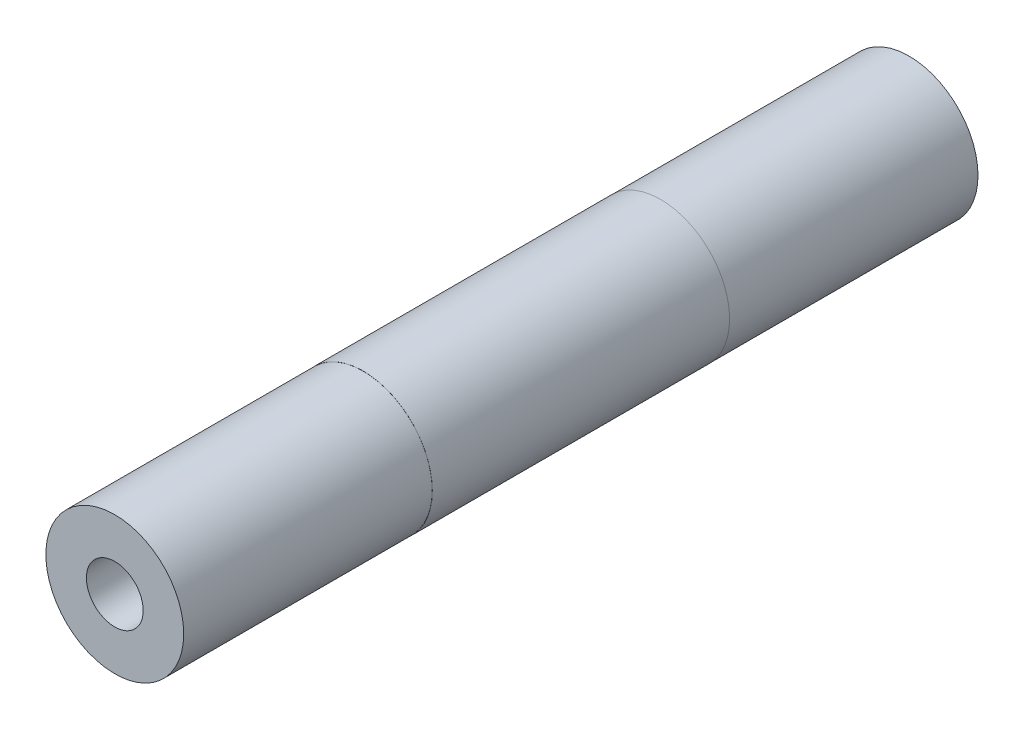
ISO-10303-21;
HEADER;
FILE_DESCRIPTION(('STEP AP214'),'2;1');
FILE_NAME('part.step','',(''),(''),'','','');
FILE_SCHEMA(('AUTOMOTIVE_DESIGN { 1 0 10303 214 1 1 1 1 }'));
ENDSEC;
DATA;
#1=APPLICATION_CONTEXT('core data for automotive mechanical design processes');
#2=APPLICATION_PROTOCOL_DEFINITION('international standard','automotive_design',2000,#1);
#3=PRODUCT_CONTEXT('',#1,'mechanical');
#4=PRODUCT('Part','Part','',(#3));
#5=PRODUCT_RELATED_PRODUCT_CATEGORY('part','',(#4));
#6=PRODUCT_DEFINITION_FORMATION('','',#4);
#7=PRODUCT_DEFINITION_CONTEXT('part definition',#1,'design');
#8=PRODUCT_DEFINITION('design','',#6,#7);
#9=PRODUCT_DEFINITION_SHAPE('','',#8);
#10=(LENGTH_UNIT() NAMED_UNIT(*) SI_UNIT(.MILLI.,.METRE.));
#11=(NAMED_UNIT(*) PLANE_ANGLE_UNIT() SI_UNIT($,.RADIAN.));
#12=(NAMED_UNIT(*) SI_UNIT($,.STERADIAN.) SOLID_ANGLE_UNIT());
#13=UNCERTAINTY_MEASURE_WITH_UNIT(LENGTH_MEASURE(1.E-05),#10,'distance_accuracy_value','');
#14=(GEOMETRIC_REPRESENTATION_CONTEXT(3) GLOBAL_UNCERTAINTY_ASSIGNED_CONTEXT((#13)) GLOBAL_UNIT_ASSIGNED_CONTEXT((#10,
#11,#12)) REPRESENTATION_CONTEXT('',''));
#15=CARTESIAN_POINT('',(0.,0.,0.));
#16=DIRECTION('',(0.,0.,1.));
#17=DIRECTION('',(1.,0.,0.));
#18=AXIS2_PLACEMENT_3D('',#15,#16,#17);
#19=CARTESIAN_POINT('',(0.,0.,45.6692));
#20=DIRECTION('',(0.,0.,-1.));
#21=DIRECTION('',(-1.,0.,0.));
#22=AXIS2_PLACEMENT_3D('',#19,#20,#21);
#23=CYLINDRICAL_SURFACE('',#22,7.9375);
#24=CARTESIAN_POINT('',(0.,0.,17.0942));
#25=DIRECTION('',(0.,0.,1.));
#26=DIRECTION('',(1.,0.,0.));
#27=AXIS2_PLACEMENT_3D('',#24,#25,#26);
#28=CIRCLE('',#27,7.9375);
#29=CARTESIAN_POINT('',(7.9375,0.,17.0942));
#30=VERTEX_POINT('',#29);
#31=EDGE_CURVE('E65',#30,#30,#28,.T.);
#32=ORIENTED_EDGE('',*,*,#31,.F.);
#33=EDGE_LOOP('',(#32));
#34=FACE_BOUND('',#33,.T.);
#35=CARTESIAN_POINT('',(0.,0.,-17.0942));
#36=DIRECTION('',(0.,0.,1.));
#37=DIRECTION('',(1.,0.,0.));
#38=AXIS2_PLACEMENT_3D('',#35,#36,#37);
#39=CIRCLE('',#38,7.9375);
#40=CARTESIAN_POINT('',(7.9375,0.,-17.0942));
#41=VERTEX_POINT('',#40);
#42=EDGE_CURVE('E74',#41,#41,#39,.T.);
#43=ORIENTED_EDGE('',*,*,#42,.T.);
#44=EDGE_LOOP('',(#43));
#45=FACE_BOUND('',#44,.T.);
#46=ADVANCED_FACE('F38',(#34,#45),#23,.T.);
#47=CARTESIAN_POINT('',(0.,0.,17.0942));
#48=DIRECTION('',(0.,0.,1.));
#49=DIRECTION('',(1.,0.,0.));
#50=AXIS2_PLACEMENT_3D('',#47,#48,#49);
#51=PLANE('',#50);
#52=CARTESIAN_POINT('',(0.,0.,17.0942));
#53=DIRECTION('',(0.,0.,1.));
#54=DIRECTION('',(1.,0.,0.));
#55=AXIS2_PLACEMENT_3D('',#52,#53,#54);
#56=CIRCLE('',#55,7.9248);
#57=CARTESIAN_POINT('',(7.9248,0.,17.0942));
#58=VERTEX_POINT('',#57);
#59=EDGE_CURVE('E70',#58,#58,#56,.T.);
#60=ORIENTED_EDGE('',*,*,#59,.F.);
#61=EDGE_LOOP('',(#60));
#62=FACE_BOUND('',#61,.T.);
#63=ORIENTED_EDGE('',*,*,#31,.T.);
#64=EDGE_LOOP('',(#63));
#65=FACE_BOUND('',#64,.T.);
#66=ADVANCED_FACE('F103',(#62,#65),#51,.T.);
#67=CARTESIAN_POINT('',(0.,0.,17.0942));
#68=DIRECTION('',(0.,0.,1.));
#69=DIRECTION('',(1.,0.,0.));
#70=AXIS2_PLACEMENT_3D('',#67,#68,#69);
#71=CYLINDRICAL_SURFACE('',#70,7.9248);
#72=ORIENTED_EDGE('',*,*,#59,.T.);
#73=EDGE_LOOP('',(#72));
#74=FACE_BOUND('',#73,.T.);
#75=CARTESIAN_POINT('',(0.,0.,45.6692));
#76=DIRECTION('',(0.,0.,1.));
#77=DIRECTION('',(1.,0.,0.));
#78=AXIS2_PLACEMENT_3D('',#75,#76,#77);
#79=CIRCLE('',#78,7.9248);
#80=CARTESIAN_POINT('',(7.9248,0.,45.6692));
#81=VERTEX_POINT('',#80);
#82=EDGE_CURVE('E71',#81,#81,#79,.T.);
#83=ORIENTED_EDGE('',*,*,#82,.F.);
#84=EDGE_LOOP('',(#83));
#85=FACE_BOUND('',#84,.T.);
#86=ADVANCED_FACE('F108',(#74,#85),#71,.T.);
#87=CARTESIAN_POINT('',(0.,0.,25.6032));
#88=DIRECTION('',(0.,0.,1.));
#89=DIRECTION('',(1.,0.,0.));
#90=AXIS2_PLACEMENT_3D('',#87,#88,#89);
#91=CONICAL_SURFACE('',#90,3.2639,1.02974425867665);
#92=CARTESIAN_POINT('',(0.,0.,23.6420510255559));
#93=VERTEX_POINT('',#92);
#94=VERTEX_LOOP('',#93);
#95=FACE_BOUND('',#94,.T.);
#96=CARTESIAN_POINT('',(0.,0.,25.6032));
#97=DIRECTION('',(0.,0.,1.));
#98=DIRECTION('',(1.,0.,0.));
#99=AXIS2_PLACEMENT_3D('',#96,#97,#98);
#100=CIRCLE('',#99,3.2639);
#101=CARTESIAN_POINT('',(3.2639,0.,25.6032));
#102=VERTEX_POINT('',#101);
#103=EDGE_CURVE('E11',#102,#102,#100,.T.);
#104=ORIENTED_EDGE('',*,*,#103,.T.);
#105=EDGE_LOOP('',(#104));
#106=FACE_BOUND('',#105,.T.);
#107=ADVANCED_FACE('F125',(#95,#106),#91,.F.);
#108=CARTESIAN_POINT('',(0.,0.,45.6692));
#109=DIRECTION('',(0.,0.,1.));
#110=DIRECTION('',(1.,0.,0.));
#111=AXIS2_PLACEMENT_3D('',#108,#109,#110);
#112=CYLINDRICAL_SURFACE('',#111,3.2639);
#113=ORIENTED_EDGE('',*,*,#103,.F.);
#114=EDGE_LOOP('',(#113));
#115=FACE_BOUND('',#114,.T.);
#116=CARTESIAN_POINT('',(0.,0.,45.6692));
#117=DIRECTION('',(0.,0.,1.));
#118=DIRECTION('',(1.,0.,0.));
#119=AXIS2_PLACEMENT_3D('',#116,#117,#118);
#120=CIRCLE('',#119,3.2639);
#121=CARTESIAN_POINT('',(3.2639,0.,45.6692));
#122=VERTEX_POINT('',#121);
#123=EDGE_CURVE('E45',#122,#122,#120,.T.);
#124=ORIENTED_EDGE('',*,*,#123,.T.);
#125=EDGE_LOOP('',(#124));
#126=FACE_BOUND('',#125,.T.);
#127=ADVANCED_FACE('F121',(#115,#126),#112,.F.);
#128=CARTESIAN_POINT('',(0.,0.,45.6692));
#129=DIRECTION('',(0.,0.,1.));
#130=DIRECTION('',(1.,0.,0.));
#131=AXIS2_PLACEMENT_3D('',#128,#129,#130);
#132=PLANE('',#131);
#133=ORIENTED_EDGE('',*,*,#123,.F.);
#134=EDGE_LOOP('',(#133));
#135=FACE_BOUND('',#134,.T.);
#136=ORIENTED_EDGE('',*,*,#82,.T.);
#137=EDGE_LOOP('',(#136));
#138=FACE_BOUND('',#137,.T.);
#139=ADVANCED_FACE('F116',(#135,#138),#132,.T.);
#140=CARTESIAN_POINT('',(0.,0.,-17.0942));
#141=DIRECTION('',(0.,0.,-1.));
#142=DIRECTION('',(1.,0.,0.));
#143=AXIS2_PLACEMENT_3D('',#140,#141,#142);
#144=PLANE('',#143);
#145=ORIENTED_EDGE('',*,*,#42,.F.);
#146=EDGE_LOOP('',(#145));
#147=FACE_BOUND('',#146,.T.);
#148=CARTESIAN_POINT('',(0.,0.,-17.0942));
#149=DIRECTION('',(0.,0.,1.));
#150=DIRECTION('',(1.,0.,0.));
#151=AXIS2_PLACEMENT_3D('',#148,#149,#150);
#152=CIRCLE('',#151,7.9248);
#153=CARTESIAN_POINT('',(7.9248,0.,-17.0942));
#154=VERTEX_POINT('',#153);
#155=EDGE_CURVE('E79',#154,#154,#152,.T.);
#156=ORIENTED_EDGE('',*,*,#155,.T.);
#157=EDGE_LOOP('',(#156));
#158=FACE_BOUND('',#157,.T.);
#159=ADVANCED_FACE('F86',(#147,#158),#144,.T.);
#160=CARTESIAN_POINT('',(0.,0.,-17.0942));
#161=DIRECTION('',(0.,0.,-1.));
#162=DIRECTION('',(-1.,0.,0.));
#163=AXIS2_PLACEMENT_3D('',#160,#161,#162);
#164=CYLINDRICAL_SURFACE('',#163,7.9248);
#165=ORIENTED_EDGE('',*,*,#155,.F.);
#166=EDGE_LOOP('',(#165));
#167=FACE_BOUND('',#166,.T.);
#168=CARTESIAN_POINT('',(0.,0.,-45.6692));
#169=DIRECTION('',(0.,0.,1.));
#170=DIRECTION('',(1.,0.,0.));
#171=AXIS2_PLACEMENT_3D('',#168,#169,#170);
#172=CIRCLE('',#171,7.9248);
#173=CARTESIAN_POINT('',(7.9248,0.,-45.6692));
#174=VERTEX_POINT('',#173);
#175=EDGE_CURVE('E80',#174,#174,#172,.T.);
#176=ORIENTED_EDGE('',*,*,#175,.T.);
#177=EDGE_LOOP('',(#176));
#178=FACE_BOUND('',#177,.T.);
#179=ADVANCED_FACE('F55',(#167,#178),#164,.T.);
#180=CARTESIAN_POINT('',(0.,0.,-25.6032));
#181=DIRECTION('',(0.,0.,-1.));
#182=DIRECTION('',(-1.,0.,0.));
#183=AXIS2_PLACEMENT_3D('',#180,#181,#182);
#184=CONICAL_SURFACE('',#183,3.2639,1.02974425867665);
#185=CARTESIAN_POINT('',(0.,0.,-23.6420510255559));
#186=VERTEX_POINT('',#185);
#187=VERTEX_LOOP('',#186);
#188=FACE_BOUND('',#187,.T.);
#189=CARTESIAN_POINT('',(0.,0.,-25.6032));
#190=DIRECTION('',(0.,0.,-1.));
#191=DIRECTION('',(-1.,0.,0.));
#192=AXIS2_PLACEMENT_3D('',#189,#190,#191);
#193=CIRCLE('',#192,3.2639);
#194=CARTESIAN_POINT('',(-3.2639,0.,-25.6032));
#195=VERTEX_POINT('',#194);
#196=EDGE_CURVE('E59',#195,#195,#193,.T.);
#197=ORIENTED_EDGE('',*,*,#196,.T.);
#198=EDGE_LOOP('',(#197));
#199=FACE_BOUND('',#198,.T.);
#200=ADVANCED_FACE('F51',(#188,#199),#184,.F.);
#201=CARTESIAN_POINT('',(0.,0.,-45.6692));
#202=DIRECTION('',(0.,0.,-1.));
#203=DIRECTION('',(-1.,0.,0.));
#204=AXIS2_PLACEMENT_3D('',#201,#202,#203);
#205=CYLINDRICAL_SURFACE('',#204,3.2639);
#206=ORIENTED_EDGE('',*,*,#196,.F.);
#207=EDGE_LOOP('',(#206));
#208=FACE_BOUND('',#207,.T.);
#209=CARTESIAN_POINT('',(0.,0.,-45.6692));
#210=DIRECTION('',(0.,0.,-1.));
#211=DIRECTION('',(-1.,0.,0.));
#212=AXIS2_PLACEMENT_3D('',#209,#210,#211);
#213=CIRCLE('',#212,3.2639);
#214=CARTESIAN_POINT('',(-3.2639,0.,-45.6692));
#215=VERTEX_POINT('',#214);
#216=EDGE_CURVE('E61',#215,#215,#213,.T.);
#217=ORIENTED_EDGE('',*,*,#216,.T.);
#218=EDGE_LOOP('',(#217));
#219=FACE_BOUND('',#218,.T.);
#220=ADVANCED_FACE('F54',(#208,#219),#205,.F.);
#221=CARTESIAN_POINT('',(0.,0.,-45.6692));
#222=DIRECTION('',(0.,0.,1.));
#223=DIRECTION('',(1.,0.,0.));
#224=AXIS2_PLACEMENT_3D('',#221,#222,#223);
#225=PLANE('',#224);
#226=ORIENTED_EDGE('',*,*,#216,.F.);
#227=EDGE_LOOP('',(#226));
#228=FACE_BOUND('',#227,.T.);
#229=ORIENTED_EDGE('',*,*,#175,.F.);
#230=EDGE_LOOP('',(#229));
#231=FACE_BOUND('',#230,.T.);
#232=ADVANCED_FACE('F93',(#228,#231),#225,.F.);
#233=CLOSED_SHELL('',(#46,#66,#86,#107,#127,#139,#159,#179,#200,#220,#232));
#234=MANIFOLD_SOLID_BREP('B2',#233);
#235=ADVANCED_BREP_SHAPE_REPRESENTATION('',(#18,#234),#14);
#236=SHAPE_DEFINITION_REPRESENTATION(#9,#235);
ENDSEC;
END-ISO-10303-21;
